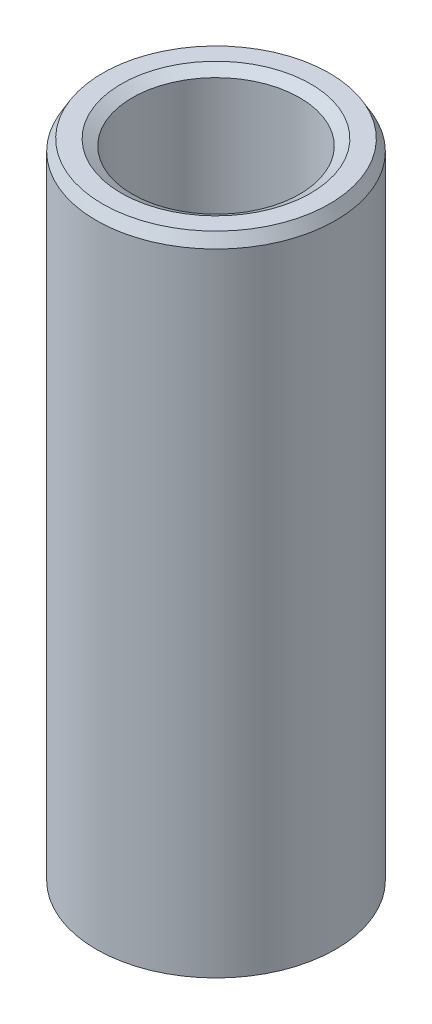
ISO-10303-21;
HEADER;
FILE_DESCRIPTION(('STEP AP214'),'2;1');
FILE_NAME('part.step','',(''),(''),'','','');
FILE_SCHEMA(('AUTOMOTIVE_DESIGN { 1 0 10303 214 1 1 1 1 }'));
ENDSEC;
DATA;
#1=APPLICATION_CONTEXT('core data for automotive mechanical design processes');
#2=APPLICATION_PROTOCOL_DEFINITION('international standard','automotive_design',2000,#1);
#3=PRODUCT_CONTEXT('',#1,'mechanical');
#4=PRODUCT('Part','Part','',(#3));
#5=PRODUCT_RELATED_PRODUCT_CATEGORY('part','',(#4));
#6=PRODUCT_DEFINITION_FORMATION('','',#4);
#7=PRODUCT_DEFINITION_CONTEXT('part definition',#1,'design');
#8=PRODUCT_DEFINITION('design','',#6,#7);
#9=PRODUCT_DEFINITION_SHAPE('','',#8);
#10=(LENGTH_UNIT() NAMED_UNIT(*) SI_UNIT(.MILLI.,.METRE.));
#11=(NAMED_UNIT(*) PLANE_ANGLE_UNIT() SI_UNIT($,.RADIAN.));
#12=(NAMED_UNIT(*) SI_UNIT($,.STERADIAN.) SOLID_ANGLE_UNIT());
#13=UNCERTAINTY_MEASURE_WITH_UNIT(LENGTH_MEASURE(1.E-05),#10,'distance_accuracy_value','');
#14=(GEOMETRIC_REPRESENTATION_CONTEXT(3) GLOBAL_UNCERTAINTY_ASSIGNED_CONTEXT((#13)) GLOBAL_UNIT_ASSIGNED_CONTEXT((#10,
#11,#12)) REPRESENTATION_CONTEXT('',''));
#15=CARTESIAN_POINT('',(0.,0.,0.));
#16=DIRECTION('',(0.,0.,1.));
#17=DIRECTION('',(1.,0.,0.));
#18=AXIS2_PLACEMENT_3D('',#15,#16,#17);
#19=CARTESIAN_POINT('',(0.,216.647198360304,0.));
#20=DIRECTION('',(0.,-1.,0.));
#21=DIRECTION('',(0.,0.,-1.));
#22=AXIS2_PLACEMENT_3D('',#19,#20,#21);
#23=CYLINDRICAL_SURFACE('',#22,40.);
#24=CARTESIAN_POINT('',(0.,2.12867717854048,0.));
#25=DIRECTION('',(0.,1.,0.));
#26=DIRECTION('',(0.,0.,1.));
#27=AXIS2_PLACEMENT_3D('',#24,#25,#26);
#28=CIRCLE('',#27,40.);
#29=CARTESIAN_POINT('',(0.,2.12867717854048,-40.));
#30=VERTEX_POINT('',#29);
#31=EDGE_CURVE('E10',#30,#30,#28,.T.);
#32=CARTESIAN_POINT('',(0.,212.96022133416,0.));
#33=DIRECTION('',(0.,1.,0.));
#34=DIRECTION('',(0.,0.,1.));
#35=AXIS2_PLACEMENT_3D('',#32,#33,#34);
#36=CIRCLE('',#35,40.);
#37=CARTESIAN_POINT('',(0.,212.96022133416,-40.));
#38=VERTEX_POINT('',#37);
#39=EDGE_CURVE('E50',#38,#38,#36,.F.);
#40=CARTESIAN_POINT('',(0.,2.12867717854048,-40.));
#41=CARTESIAN_POINT('',(0.,4.32483909682818,-40.));
#42=CARTESIAN_POINT('',(0.,6.52100101511588,-40.));
#43=CARTESIAN_POINT('',(0.,10.9133248516913,-40.));
#44=CARTESIAN_POINT('',(0.,13.109486769979,-40.));
#45=CARTESIAN_POINT('',(0.,17.5018106065544,-40.));
#46=CARTESIAN_POINT('',(0.,19.6979725248421,-40.));
#47=CARTESIAN_POINT('',(0.,24.0902963614175,-40.));
#48=CARTESIAN_POINT('',(0.,26.2864582797052,-40.));
#49=CARTESIAN_POINT('',(0.,30.6787821162806,-40.));
#50=CARTESIAN_POINT('',(0.,32.8749440345683,-40.));
#51=CARTESIAN_POINT('',(0.,37.2672678711437,-40.));
#52=CARTESIAN_POINT('',(0.,39.4634297894314,-40.));
#53=CARTESIAN_POINT('',(0.,43.8557536260068,-40.));
#54=CARTESIAN_POINT('',(0.,46.0519155442945,-40.));
#55=CARTESIAN_POINT('',(0.,50.4442393808699,-40.));
#56=CARTESIAN_POINT('',(0.,52.6404012991576,-40.));
#57=CARTESIAN_POINT('',(0.,57.032725135733,-40.));
#58=CARTESIAN_POINT('',(0.,59.2288870540207,-40.));
#59=CARTESIAN_POINT('',(0.,63.6212108905961,-40.));
#60=CARTESIAN_POINT('',(0.,65.8173728088838,-40.));
#61=CARTESIAN_POINT('',(0.,70.2096966454592,-40.));
#62=CARTESIAN_POINT('',(0.,72.4058585637469,-40.));
#63=CARTESIAN_POINT('',(0.,76.7981824003223,-40.));
#64=CARTESIAN_POINT('',(0.,78.99434431861,-40.));
#65=CARTESIAN_POINT('',(0.,83.3866681551854,-40.));
#66=CARTESIAN_POINT('',(0.,85.5828300734731,-40.));
#67=CARTESIAN_POINT('',(0.,89.9751539100485,-40.));
#68=CARTESIAN_POINT('',(0.,92.1713158283362,-40.));
#69=CARTESIAN_POINT('',(0.,96.5636396649116,-40.));
#70=CARTESIAN_POINT('',(0.,98.7598015831993,-40.));
#71=CARTESIAN_POINT('',(0.,103.152125419775,-40.));
#72=CARTESIAN_POINT('',(0.,105.348287338062,-40.));
#73=CARTESIAN_POINT('',(0.,109.740611174638,-40.));
#74=CARTESIAN_POINT('',(0.,111.936773092926,-40.));
#75=CARTESIAN_POINT('',(0.,116.329096929501,-40.));
#76=CARTESIAN_POINT('',(0.,118.525258847789,-40.));
#77=CARTESIAN_POINT('',(0.,122.917582684364,-40.));
#78=CARTESIAN_POINT('',(0.,125.113744602652,-40.));
#79=CARTESIAN_POINT('',(0.,129.506068439227,-40.));
#80=CARTESIAN_POINT('',(0.,131.702230357515,-40.));
#81=CARTESIAN_POINT('',(0.,136.09455419409,-40.));
#82=CARTESIAN_POINT('',(0.,138.290716112378,-40.));
#83=CARTESIAN_POINT('',(0.,142.683039948953,-40.));
#84=CARTESIAN_POINT('',(0.,144.879201867241,-40.));
#85=CARTESIAN_POINT('',(0.,149.271525703816,-40.));
#86=CARTESIAN_POINT('',(0.,151.467687622104,-40.));
#87=CARTESIAN_POINT('',(0.,155.86001145868,-40.));
#88=CARTESIAN_POINT('',(0.,158.056173376967,-40.));
#89=CARTESIAN_POINT('',(0.,162.448497213543,-40.));
#90=CARTESIAN_POINT('',(0.,164.64465913183,-40.));
#91=CARTESIAN_POINT('',(0.,169.036982968406,-40.));
#92=CARTESIAN_POINT('',(0.,171.233144886693,-40.));
#93=CARTESIAN_POINT('',(0.,175.625468723269,-40.));
#94=CARTESIAN_POINT('',(0.,177.821630641557,-40.));
#95=CARTESIAN_POINT('',(0.,182.213954478132,-40.));
#96=CARTESIAN_POINT('',(0.,184.41011639642,-40.));
#97=CARTESIAN_POINT('',(0.,188.802440232995,-40.));
#98=CARTESIAN_POINT('',(0.,190.998602151283,-40.));
#99=CARTESIAN_POINT('',(0.,195.390925987858,-40.));
#100=CARTESIAN_POINT('',(0.,197.587087906146,-40.));
#101=CARTESIAN_POINT('',(0.,201.979411742721,-40.));
#102=CARTESIAN_POINT('',(0.,204.175573661009,-40.));
#103=CARTESIAN_POINT('',(0.,208.567897497584,-40.));
#104=CARTESIAN_POINT('',(0.,210.764059415872,-40.));
#105=CARTESIAN_POINT('',(0.,212.96022133416,-40.));
#106=B_SPLINE_CURVE_WITH_KNOTS('',3,(#40,#41,#42,#43,#44,#45,#46,#47,#48,#49,#50,#51,#52,#53,
#54,#55,#56,#57,#58,#59,#60,#61,#62,#63,#64,#65,#66,#67,#68,#69,#70,#71,#72,#73,#74,#75,#76,#77,
#78,#79,#80,#81,#82,#83,#84,#85,#86,#87,#88,#89,#90,#91,#92,#93,#94,#95,#96,#97,#98,#99,#100,
#101,#102,#103,#104,#105),.UNSPECIFIED.,.F.,.F.,(4,2,2,2,2,2,2,2,2,2,2,2,2,2,2,2,2,2,2,2,2,2,2,
2,2,2,2,2,2,2,2,2,4),(0.,6.58848575486309,13.1769715097262,19.7654572645893,26.3539430194524,
32.9424287743155,39.5309145291786,46.1194002840417,52.7078860389048,59.2963717937679,
65.884857548631,72.4733433034941,79.0618290583572,85.6503148132203,92.2388005680834,
98.8272863229465,105.41577207781,112.004257832673,118.592743587536,125.181229342399,
131.769715097262,138.358200852125,144.946686606988,151.535172361851,158.123658116714,
164.712143871578,171.300629626441,177.889115381304,184.477601136167,191.06608689103,
197.654572645893,204.243058400756,210.831544155619),.UNSPECIFIED.);
#107=EDGE_CURVE('BSEAM39',#30,#38,#106,.T.);
#108=ORIENTED_EDGE('',*,*,#31,.T.);
#109=ORIENTED_EDGE('',*,*,#39,.T.);
#110=ORIENTED_EDGE('',*,*,#107,.T.);
#111=ORIENTED_EDGE('',*,*,#107,.F.);
#112=EDGE_LOOP('',(#108,#110,#109,#111));
#113=FACE_BOUND('',#112,.T.);
#114=ADVANCED_FACE('F39',(#113),#23,.T.);
#115=CARTESIAN_POINT('',(0.,216.647198360304,0.));
#116=DIRECTION('',(0.,1.,0.));
#117=DIRECTION('',(0.,0.,1.));
#118=AXIS2_PLACEMENT_3D('',#115,#116,#117);
#119=PLANE('',#118);
#120=CARTESIAN_POINT('',(0.,216.647198360304,0.));
#121=DIRECTION('',(0.,1.,0.));
#122=DIRECTION('',(0.,0.,1.));
#123=AXIS2_PLACEMENT_3D('',#120,#121,#122);
#124=CIRCLE('',#123,31.6277676321509);
#125=CARTESIAN_POINT('',(0.,216.647198360304,31.6277676321509));
#126=VERTEX_POINT('',#125);
#127=EDGE_CURVE('E58',#126,#126,#124,.F.);
#128=ORIENTED_EDGE('',*,*,#127,.T.);
#129=EDGE_LOOP('',(#128));
#130=FACE_BOUND('',#129,.T.);
#131=CARTESIAN_POINT('',(0.,216.647198360304,0.));
#132=DIRECTION('',(0.,1.,0.));
#133=DIRECTION('',(0.,0.,1.));
#134=AXIS2_PLACEMENT_3D('',#131,#132,#133);
#135=CIRCLE('',#134,37.8713228214597);
#136=CARTESIAN_POINT('',(0.,216.647198360304,37.8713228214597));
#137=VERTEX_POINT('',#136);
#138=EDGE_CURVE('E61',#137,#137,#135,.T.);
#139=ORIENTED_EDGE('',*,*,#138,.T.);
#140=EDGE_LOOP('',(#139));
#141=FACE_BOUND('',#140,.T.);
#142=ADVANCED_FACE('F88',(#130,#141),#119,.T.);
#143=CARTESIAN_POINT('',(0.,0.,0.));
#144=DIRECTION('',(0.,1.,0.));
#145=DIRECTION('',(0.,0.,1.));
#146=AXIS2_PLACEMENT_3D('',#143,#144,#145);
#147=PLANE('',#146);
#148=CARTESIAN_POINT('',(0.,0.,0.));
#149=DIRECTION('',(0.,1.,0.));
#150=DIRECTION('',(0.,0.,1.));
#151=AXIS2_PLACEMENT_3D('',#148,#149,#150);
#152=CIRCLE('',#151,30.0694677845468);
#153=CARTESIAN_POINT('',(0.,0.,30.0694677845468));
#154=VERTEX_POINT('',#153);
#155=EDGE_CURVE('E51',#154,#154,#152,.T.);
#156=ORIENTED_EDGE('',*,*,#155,.T.);
#157=EDGE_LOOP('',(#156));
#158=FACE_BOUND('',#157,.T.);
#159=CARTESIAN_POINT('',(0.,0.,0.));
#160=DIRECTION('',(0.,1.,0.));
#161=DIRECTION('',(0.,0.,1.));
#162=AXIS2_PLACEMENT_3D('',#159,#160,#161);
#163=CIRCLE('',#162,36.3130229738555);
#164=CARTESIAN_POINT('',(0.,0.,36.3130229738555));
#165=VERTEX_POINT('',#164);
#166=EDGE_CURVE('E54',#165,#165,#163,.F.);
#167=ORIENTED_EDGE('',*,*,#166,.T.);
#168=EDGE_LOOP('',(#167));
#169=FACE_BOUND('',#168,.T.);
#170=ADVANCED_FACE('F83',(#158,#169),#147,.F.);
#171=CARTESIAN_POINT('',(0.,216.647198360304,0.));
#172=DIRECTION('',(0.,-1.,0.));
#173=DIRECTION('',(0.,0.,-1.));
#174=AXIS2_PLACEMENT_3D('',#171,#172,#173);
#175=CYLINDRICAL_SURFACE('',#174,27.9407906060065);
#176=CARTESIAN_POINT('',(0.,214.518521181763,0.));
#177=DIRECTION('',(0.,1.,0.));
#178=DIRECTION('',(0.,0.,1.));
#179=AXIS2_PLACEMENT_3D('',#176,#177,#178);
#180=CIRCLE('',#179,27.9407906060065);
#181=CARTESIAN_POINT('',(0.,214.518521181763,-27.9407906060065));
#182=VERTEX_POINT('',#181);
#183=EDGE_CURVE('E67',#182,#182,#180,.T.);
#184=CARTESIAN_POINT('',(0.,3.6869770261444,0.));
#185=DIRECTION('',(0.,1.,0.));
#186=DIRECTION('',(0.,0.,1.));
#187=AXIS2_PLACEMENT_3D('',#184,#185,#186);
#188=CIRCLE('',#187,27.9407906060065);
#189=CARTESIAN_POINT('',(0.,3.6869770261444,-27.9407906060065));
#190=VERTEX_POINT('',#189);
#191=EDGE_CURVE('E69',#190,#190,#188,.F.);
#192=CARTESIAN_POINT('',(0.,214.518521181763,-27.9407906060065));
#193=CARTESIAN_POINT('',(0.,212.322359263476,-27.9407906060065));
#194=CARTESIAN_POINT('',(0.,210.126197345188,-27.9407906060065));
#195=CARTESIAN_POINT('',(0.,205.733873508613,-27.9407906060065));
#196=CARTESIAN_POINT('',(0.,203.537711590325,-27.9407906060065));
#197=CARTESIAN_POINT('',(0.,199.14538775375,-27.9407906060065));
#198=CARTESIAN_POINT('',(0.,196.949225835462,-27.9407906060065));
#199=CARTESIAN_POINT('',(0.,192.556901998886,-27.9407906060065));
#200=CARTESIAN_POINT('',(0.,190.360740080599,-27.9407906060065));
#201=CARTESIAN_POINT('',(0.,185.968416244023,-27.9407906060065));
#202=CARTESIAN_POINT('',(0.,183.772254325736,-27.9407906060065));
#203=CARTESIAN_POINT('',(0.,179.37993048916,-27.9407906060065));
#204=CARTESIAN_POINT('',(0.,177.183768570873,-27.9407906060065));
#205=CARTESIAN_POINT('',(0.,172.791444734297,-27.9407906060065));
#206=CARTESIAN_POINT('',(0.,170.595282816009,-27.9407906060065));
#207=CARTESIAN_POINT('',(0.,166.202958979434,-27.9407906060065));
#208=CARTESIAN_POINT('',(0.,164.006797061146,-27.9407906060065));
#209=CARTESIAN_POINT('',(0.,159.614473224571,-27.9407906060065));
#210=CARTESIAN_POINT('',(0.,157.418311306283,-27.9407906060065));
#211=CARTESIAN_POINT('',(0.,153.025987469708,-27.9407906060065));
#212=CARTESIAN_POINT('',(0.,150.82982555142,-27.9407906060065));
#213=CARTESIAN_POINT('',(0.,146.437501714845,-27.9407906060065));
#214=CARTESIAN_POINT('',(0.,144.241339796557,-27.9407906060065));
#215=CARTESIAN_POINT('',(0.,139.849015959982,-27.9407906060065));
#216=CARTESIAN_POINT('',(0.,137.652854041694,-27.9407906060065));
#217=CARTESIAN_POINT('',(0.,133.260530205119,-27.9407906060065));
#218=CARTESIAN_POINT('',(0.,131.064368286831,-27.9407906060065));
#219=CARTESIAN_POINT('',(0.,126.672044450255,-27.9407906060065));
#220=CARTESIAN_POINT('',(0.,124.475882531968,-27.9407906060065));
#221=CARTESIAN_POINT('',(0.,120.083558695392,-27.9407906060065));
#222=CARTESIAN_POINT('',(0.,117.887396777105,-27.9407906060065));
#223=CARTESIAN_POINT('',(0.,113.495072940529,-27.9407906060065));
#224=CARTESIAN_POINT('',(0.,111.298911022242,-27.9407906060065));
#225=CARTESIAN_POINT('',(0.,106.906587185666,-27.9407906060065));
#226=CARTESIAN_POINT('',(0.,104.710425267378,-27.9407906060065));
#227=CARTESIAN_POINT('',(0.,100.318101430803,-27.9407906060065));
#228=CARTESIAN_POINT('',(0.,98.1219395125154,-27.9407906060065));
#229=CARTESIAN_POINT('',(0.,93.72961567594,-27.9407906060065));
#230=CARTESIAN_POINT('',(0.,91.5334537576523,-27.9407906060065));
#231=CARTESIAN_POINT('',(0.,87.1411299210769,-27.9407906060065));
#232=CARTESIAN_POINT('',(0.,84.9449680027892,-27.9407906060065));
#233=CARTESIAN_POINT('',(0.,80.5526441662138,-27.9407906060065));
#234=CARTESIAN_POINT('',(0.,78.3564822479261,-27.9407906060065));
#235=CARTESIAN_POINT('',(0.,73.9641584113507,-27.9407906060065));
#236=CARTESIAN_POINT('',(0.,71.767996493063,-27.9407906060065));
#237=CARTESIAN_POINT('',(0.,67.3756726564876,-27.9407906060065));
#238=CARTESIAN_POINT('',(0.,65.1795107381999,-27.9407906060065));
#239=CARTESIAN_POINT('',(0.,60.7871869016245,-27.9407906060065));
#240=CARTESIAN_POINT('',(0.,58.5910249833369,-27.9407906060065));
#241=CARTESIAN_POINT('',(0.,54.1987011467615,-27.9407906060065));
#242=CARTESIAN_POINT('',(0.,52.0025392284738,-27.9407906060065));
#243=CARTESIAN_POINT('',(0.,47.6102153918984,-27.9407906060065));
#244=CARTESIAN_POINT('',(0.,45.4140534736107,-27.9407906060065));
#245=CARTESIAN_POINT('',(0.,41.0217296370353,-27.9407906060065));
#246=CARTESIAN_POINT('',(0.,38.8255677187476,-27.9407906060065));
#247=CARTESIAN_POINT('',(0.,34.4332438821722,-27.9407906060065));
#248=CARTESIAN_POINT('',(0.,32.2370819638845,-27.9407906060065));
#249=CARTESIAN_POINT('',(0.,27.8447581273091,-27.9407906060065));
#250=CARTESIAN_POINT('',(0.,25.6485962090214,-27.9407906060065));
#251=CARTESIAN_POINT('',(0.,21.256272372446,-27.9407906060065));
#252=CARTESIAN_POINT('',(0.,19.0601104541583,-27.9407906060065));
#253=CARTESIAN_POINT('',(0.,14.6677866175829,-27.9407906060065));
#254=CARTESIAN_POINT('',(0.,12.4716246992952,-27.9407906060065));
#255=CARTESIAN_POINT('',(0.,8.0793008627198,-27.9407906060065));
#256=CARTESIAN_POINT('',(0.,5.8831389444321,-27.9407906060065));
#257=CARTESIAN_POINT('',(0.,3.6869770261444,-27.9407906060065));
#258=B_SPLINE_CURVE_WITH_KNOTS('',3,(#192,#193,#194,#195,#196,#197,#198,#199,#200,#201,#202,
#203,#204,#205,#206,#207,#208,#209,#210,#211,#212,#213,#214,#215,#216,#217,#218,#219,#220,#221,
#222,#223,#224,#225,#226,#227,#228,#229,#230,#231,#232,#233,#234,#235,#236,#237,#238,#239,#240,
#241,#242,#243,#244,#245,#246,#247,#248,#249,#250,#251,#252,#253,#254,#255,#256,#257),
.UNSPECIFIED.,.F.,.F.,(4,2,2,2,2,2,2,2,2,2,2,2,2,2,2,2,2,2,2,2,2,2,2,2,2,2,2,2,2,2,2,2,4),(0.,
6.58848575486307,13.1769715097262,19.7654572645893,26.3539430194523,32.9424287743154,
39.5309145291785,46.1194002840416,52.7078860389047,59.2963717937678,65.8848575486309,
72.473343303494,79.0618290583571,85.6503148132202,92.2388005680833,98.8272863229464,
105.415772077809,112.004257832673,118.592743587536,125.181229342399,131.769715097262,
138.358200852125,144.946686606988,151.535172361851,158.123658116714,164.712143871577,
171.30062962644,177.889115381303,184.477601136167,191.06608689103,197.654572645893,
204.243058400756,210.831544155619),.UNSPECIFIED.);
#259=EDGE_CURVE('BSEAM71',#182,#190,#258,.T.);
#260=ORIENTED_EDGE('',*,*,#183,.T.);
#261=ORIENTED_EDGE('',*,*,#191,.T.);
#262=ORIENTED_EDGE('',*,*,#259,.T.);
#263=ORIENTED_EDGE('',*,*,#259,.F.);
#264=EDGE_LOOP('',(#260,#262,#261,#263));
#265=FACE_BOUND('',#264,.T.);
#266=ADVANCED_FACE('F71',(#265),#175,.F.);
#267=CARTESIAN_POINT('',(0.,214.518521181763,0.));
#268=DIRECTION('',(0.,1.,0.));
#269=DIRECTION('',(0.,0.,1.));
#270=AXIS2_PLACEMENT_3D('',#267,#268,#269);
#271=CONICAL_SURFACE('',#270,27.9407906060065,1.0471975511966);
#272=ORIENTED_EDGE('',*,*,#127,.F.);
#273=EDGE_LOOP('',(#272));
#274=FACE_BOUND('',#273,.T.);
#275=ORIENTED_EDGE('',*,*,#183,.F.);
#276=EDGE_LOOP('',(#275));
#277=FACE_BOUND('',#276,.T.);
#278=ADVANCED_FACE('F77',(#274,#277),#271,.F.);
#279=CARTESIAN_POINT('',(0.,0.,0.));
#280=DIRECTION('',(0.,-1.,0.));
#281=DIRECTION('',(0.,0.,-1.));
#282=AXIS2_PLACEMENT_3D('',#279,#280,#281);
#283=CONICAL_SURFACE('',#282,30.0694677845468,0.52359877559829);
#284=ORIENTED_EDGE('',*,*,#191,.F.);
#285=EDGE_LOOP('',(#284));
#286=FACE_BOUND('',#285,.T.);
#287=ORIENTED_EDGE('',*,*,#155,.F.);
#288=EDGE_LOOP('',(#287));
#289=FACE_BOUND('',#288,.T.);
#290=ADVANCED_FACE('F73',(#286,#289),#283,.F.);
#291=CARTESIAN_POINT('',(0.,2.12867717854048,0.));
#292=DIRECTION('',(0.,1.,0.));
#293=DIRECTION('',(0.,0.,1.));
#294=AXIS2_PLACEMENT_3D('',#291,#292,#293);
#295=CONICAL_SURFACE('',#294,40.,1.0471975511966);
#296=ORIENTED_EDGE('',*,*,#166,.F.);
#297=EDGE_LOOP('',(#296));
#298=FACE_BOUND('',#297,.T.);
#299=ORIENTED_EDGE('',*,*,#31,.F.);
#300=EDGE_LOOP('',(#299));
#301=FACE_BOUND('',#300,.T.);
#302=ADVANCED_FACE('F76',(#298,#301),#295,.T.);
#303=CARTESIAN_POINT('',(0.,216.647198360304,0.));
#304=DIRECTION('',(0.,-1.,0.));
#305=DIRECTION('',(0.,0.,-1.));
#306=AXIS2_PLACEMENT_3D('',#303,#304,#305);
#307=CONICAL_SURFACE('',#306,37.8713228214597,0.523598775598302);
#308=ORIENTED_EDGE('',*,*,#39,.F.);
#309=EDGE_LOOP('',(#308));
#310=FACE_BOUND('',#309,.T.);
#311=ORIENTED_EDGE('',*,*,#138,.F.);
#312=EDGE_LOOP('',(#311));
#313=FACE_BOUND('',#312,.T.);
#314=ADVANCED_FACE('F45',(#310,#313),#307,.T.);
#315=CLOSED_SHELL('',(#114,#142,#170,#266,#278,#290,#302,#314));
#316=MANIFOLD_SOLID_BREP('B2',#315);
#317=ADVANCED_BREP_SHAPE_REPRESENTATION('',(#18,#316),#14);
#318=SHAPE_DEFINITION_REPRESENTATION(#9,#317);
ENDSEC;
END-ISO-10303-21;
